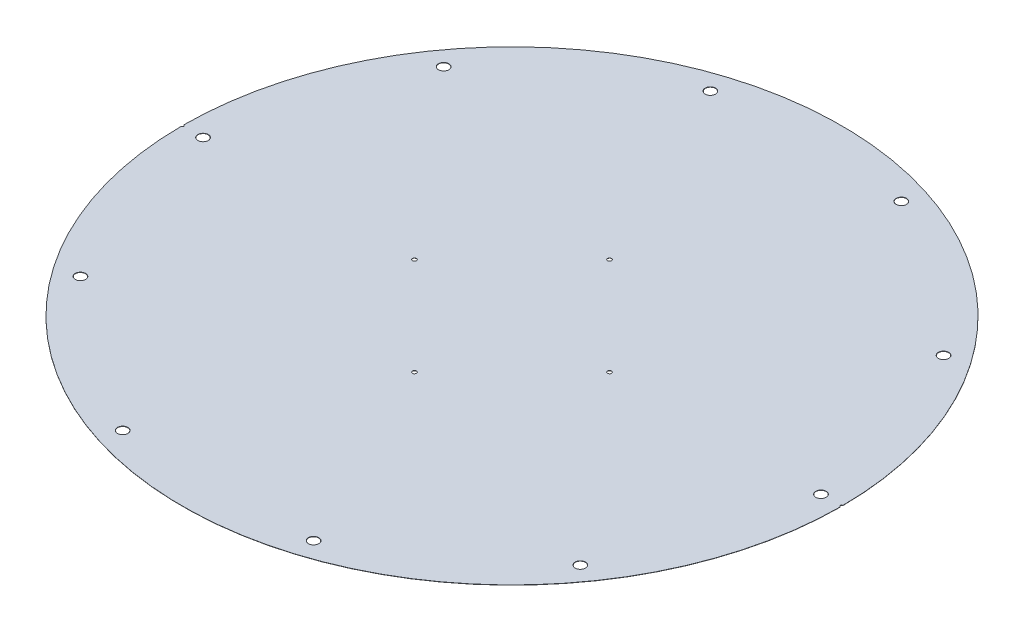
ISO-10303-21;
HEADER;
FILE_DESCRIPTION(('STEP AP214'),'2;1');
FILE_NAME('part.step','',(''),(''),'','','');
FILE_SCHEMA(('AUTOMOTIVE_DESIGN { 1 0 10303 214 1 1 1 1 }'));
ENDSEC;
DATA;
#1=APPLICATION_CONTEXT('core data for automotive mechanical design processes');
#2=APPLICATION_PROTOCOL_DEFINITION('international standard','automotive_design',2000,#1);
#3=PRODUCT_CONTEXT('',#1,'mechanical');
#4=PRODUCT('Part','Part','',(#3));
#5=PRODUCT_RELATED_PRODUCT_CATEGORY('part','',(#4));
#6=PRODUCT_DEFINITION_FORMATION('','',#4);
#7=PRODUCT_DEFINITION_CONTEXT('part definition',#1,'design');
#8=PRODUCT_DEFINITION('design','',#6,#7);
#9=PRODUCT_DEFINITION_SHAPE('','',#8);
#10=(LENGTH_UNIT() NAMED_UNIT(*) SI_UNIT(.MILLI.,.METRE.));
#11=(NAMED_UNIT(*) PLANE_ANGLE_UNIT() SI_UNIT($,.RADIAN.));
#12=(NAMED_UNIT(*) SI_UNIT($,.STERADIAN.) SOLID_ANGLE_UNIT());
#13=UNCERTAINTY_MEASURE_WITH_UNIT(LENGTH_MEASURE(1.E-05),#10,'distance_accuracy_value','');
#14=(GEOMETRIC_REPRESENTATION_CONTEXT(3) GLOBAL_UNCERTAINTY_ASSIGNED_CONTEXT((#13)) GLOBAL_UNIT_ASSIGNED_CONTEXT((#10,
#11,#12)) REPRESENTATION_CONTEXT('',''));
#15=CARTESIAN_POINT('',(0.,0.,0.));
#16=DIRECTION('',(0.,0.,1.));
#17=DIRECTION('',(1.,0.,0.));
#18=AXIS2_PLACEMENT_3D('',#15,#16,#17);
#19=CARTESIAN_POINT('',(0.,6.35,0.));
#20=DIRECTION('',(0.,-1.,0.));
#21=DIRECTION('',(0.,0.,-1.));
#22=AXIS2_PLACEMENT_3D('',#19,#20,#21);
#23=CYLINDRICAL_SURFACE('',#22,406.4);
#24=CARTESIAN_POINT('',(0.,6.096,0.));
#25=DIRECTION('',(0.,-1.,0.));
#26=DIRECTION('',(0.,0.,-1.));
#27=AXIS2_PLACEMENT_3D('',#24,#25,#26);
#28=CIRCLE('',#27,406.4);
#29=CARTESIAN_POINT('',(-406.396899414062,6.096,-1.58749697208188));
#30=VERTEX_POINT('',#29);
#31=CARTESIAN_POINT('',(406.396899414062,6.096,-1.58749697208138));
#32=VERTEX_POINT('',#31);
#33=EDGE_CURVE('E76',#30,#32,#28,.T.);
#34=ORIENTED_EDGE('',*,*,#33,.F.);
#35=DIRECTION('',(0.,1.,0.));
#36=VECTOR('',#35,1.);
#37=CARTESIAN_POINT('',(-406.396899414062,3.175,-1.58749697208118));
#38=LINE('',#37,#36);
#39=CARTESIAN_POINT('',(-406.396899414062,6.35,-1.58749697208118));
#40=VERTEX_POINT('',#39);
#41=EDGE_CURVE('E93',#30,#40,#38,.T.);
#42=ORIENTED_EDGE('',*,*,#41,.T.);
#43=CARTESIAN_POINT('',(0.,6.35,0.));
#44=DIRECTION('',(0.,1.,0.));
#45=DIRECTION('',(0.,0.,1.));
#46=AXIS2_PLACEMENT_3D('',#43,#44,#45);
#47=CIRCLE('',#46,406.4);
#48=CARTESIAN_POINT('',(406.396899414062,6.35,-1.58749697208118));
#49=VERTEX_POINT('',#48);
#50=EDGE_CURVE('E110',#49,#40,#47,.T.);
#51=ORIENTED_EDGE('',*,*,#50,.F.);
#52=DIRECTION('',(0.,1.,0.));
#53=VECTOR('',#52,1.);
#54=CARTESIAN_POINT('',(406.396899414062,3.175,-1.58749697208118));
#55=LINE('',#54,#53);
#56=EDGE_CURVE('E42',#49,#32,#55,.F.);
#57=ORIENTED_EDGE('',*,*,#56,.T.);
#58=EDGE_LOOP('',(#34,#42,#51,#57));
#59=FACE_BOUND('',#58,.T.);
#60=ADVANCED_FACE('F35',(#59),#23,.T.);
#61=CARTESIAN_POINT('',(0.,6.096,0.));
#62=DIRECTION('',(0.,-1.,0.));
#63=DIRECTION('',(0.,0.,-1.));
#64=AXIS2_PLACEMENT_3D('',#61,#62,#63);
#65=CIRCLE('',#64,406.4);
#66=CARTESIAN_POINT('',(406.396899414062,6.096,1.58749697208114));
#67=VERTEX_POINT('',#66);
#68=CARTESIAN_POINT('',(-406.396899414062,6.096,1.58749697208118));
#69=VERTEX_POINT('',#68);
#70=EDGE_CURVE('E49',#67,#69,#65,.T.);
#71=ORIENTED_EDGE('',*,*,#70,.F.);
#72=DIRECTION('',(0.,1.,0.));
#73=VECTOR('',#72,1.);
#74=CARTESIAN_POINT('',(406.396899414062,3.175,1.58749697208118));
#75=LINE('',#74,#73);
#76=CARTESIAN_POINT('',(406.396899414062,6.35,1.58749697208118));
#77=VERTEX_POINT('',#76);
#78=EDGE_CURVE('E12',#67,#77,#75,.T.);
#79=ORIENTED_EDGE('',*,*,#78,.T.);
#80=CARTESIAN_POINT('',(-406.396899414062,6.35,1.58749697208118));
#81=VERTEX_POINT('',#80);
#82=EDGE_CURVE('E113',#81,#77,#47,.T.);
#83=ORIENTED_EDGE('',*,*,#82,.F.);
#84=DIRECTION('',(0.,1.,0.));
#85=VECTOR('',#84,1.);
#86=CARTESIAN_POINT('',(-406.396899414062,3.175,1.58749697208118));
#87=LINE('',#86,#85);
#88=EDGE_CURVE('E82',#81,#69,#87,.F.);
#89=ORIENTED_EDGE('',*,*,#88,.T.);
#90=EDGE_LOOP('',(#71,#79,#83,#89));
#91=FACE_BOUND('',#90,.T.);
#92=ADVANCED_FACE('F81',(#91),#23,.T.);
#93=CARTESIAN_POINT('',(-117.735474856852,6.35,-362.352532708434));
#94=DIRECTION('',(0.,1.,0.));
#95=DIRECTION('',(0.,0.,1.));
#96=AXIS2_PLACEMENT_3D('',#93,#94,#95);
#97=CONICAL_SURFACE('',#96,6.4389,0.715584993317675);
#98=CARTESIAN_POINT('',(-117.735474856852,6.35,-362.352532708434));
#99=DIRECTION('',(0.,1.,0.));
#100=DIRECTION('',(0.,0.,1.));
#101=AXIS2_PLACEMENT_3D('',#98,#99,#100);
#102=CIRCLE('',#101,6.4389);
#103=CARTESIAN_POINT('',(-117.735474856852,6.35,-355.913632708433));
#104=VERTEX_POINT('',#103);
#105=EDGE_CURVE('E114',#104,#104,#102,.T.);
#106=ORIENTED_EDGE('',*,*,#105,.T.);
#107=EDGE_LOOP('',(#106));
#108=FACE_BOUND('',#107,.T.);
#109=CARTESIAN_POINT('',(-117.735474856852,6.096,-362.352532708434));
#110=DIRECTION('',(0.,-1.,0.));
#111=DIRECTION('',(0.,0.,-1.));
#112=AXIS2_PLACEMENT_3D('',#109,#110,#111);
#113=CIRCLE('',#112,6.21810116859467);
#114=CARTESIAN_POINT('',(-117.735474856852,6.096,-368.570633877028));
#115=VERTEX_POINT('',#114);
#116=EDGE_CURVE('E126',#115,#115,#113,.F.);
#117=ORIENTED_EDGE('',*,*,#116,.F.);
#118=EDGE_LOOP('',(#117));
#119=FACE_BOUND('',#118,.T.);
#120=ADVANCED_FACE('F295',(#108,#119),#97,.F.);
#121=CARTESIAN_POINT('',(-308.235474856828,6.35,-223.94618112338));
#122=DIRECTION('',(0.,1.,0.));
#123=DIRECTION('',(0.,0.,1.));
#124=AXIS2_PLACEMENT_3D('',#121,#122,#123);
#125=CONICAL_SURFACE('',#124,6.43890000000003,0.715584993317679);
#126=CARTESIAN_POINT('',(-308.235474856828,6.35,-223.94618112338));
#127=DIRECTION('',(0.,1.,0.));
#128=DIRECTION('',(0.,0.,1.));
#129=AXIS2_PLACEMENT_3D('',#126,#127,#128);
#130=CIRCLE('',#129,6.43890000000003);
#131=CARTESIAN_POINT('',(-308.235474856828,6.35,-217.50728112338));
#132=VERTEX_POINT('',#131);
#133=EDGE_CURVE('E129',#132,#132,#130,.T.);
#134=ORIENTED_EDGE('',*,*,#133,.T.);
#135=EDGE_LOOP('',(#134));
#136=FACE_BOUND('',#135,.T.);
#137=CARTESIAN_POINT('',(-308.235474856828,6.096,-223.94618112338));
#138=DIRECTION('',(0.,-1.,0.));
#139=DIRECTION('',(0.,0.,-1.));
#140=AXIS2_PLACEMENT_3D('',#137,#138,#139);
#141=CIRCLE('',#140,6.2181011685947);
#142=CARTESIAN_POINT('',(-308.235474856828,6.096,-230.164282291974));
#143=VERTEX_POINT('',#142);
#144=EDGE_CURVE('E280',#143,#143,#141,.F.);
#145=ORIENTED_EDGE('',*,*,#144,.F.);
#146=EDGE_LOOP('',(#145));
#147=FACE_BOUND('',#146,.T.);
#148=ADVANCED_FACE('F274',(#136,#147),#125,.F.);
#149=CARTESIAN_POINT('',(-380.999999999935,6.35,6.49720277579036E-11));
#150=DIRECTION('',(0.,1.,0.));
#151=DIRECTION('',(0.,0.,1.));
#152=AXIS2_PLACEMENT_3D('',#149,#150,#151);
#153=CONICAL_SURFACE('',#152,6.43890000000003,0.715584993317679);
#154=CARTESIAN_POINT('',(-380.999999999935,6.35,6.49720277579036E-11));
#155=DIRECTION('',(0.,1.,0.));
#156=DIRECTION('',(0.,0.,1.));
#157=AXIS2_PLACEMENT_3D('',#154,#155,#156);
#158=CIRCLE('',#157,6.43890000000003);
#159=CARTESIAN_POINT('',(-380.999999999935,6.35,6.438900000065));
#160=VERTEX_POINT('',#159);
#161=EDGE_CURVE('E133',#160,#160,#158,.T.);
#162=ORIENTED_EDGE('',*,*,#161,.T.);
#163=EDGE_LOOP('',(#162));
#164=FACE_BOUND('',#163,.T.);
#165=CARTESIAN_POINT('',(-380.999999999935,6.096,6.49720277579036E-11));
#166=DIRECTION('',(0.,-1.,0.));
#167=DIRECTION('',(0.,0.,-1.));
#168=AXIS2_PLACEMENT_3D('',#165,#166,#167);
#169=CIRCLE('',#168,6.2181011685947);
#170=CARTESIAN_POINT('',(-380.999999999935,6.096,-6.21810116852973));
#171=VERTEX_POINT('',#170);
#172=EDGE_CURVE('E278',#171,#171,#169,.F.);
#173=ORIENTED_EDGE('',*,*,#172,.F.);
#174=EDGE_LOOP('',(#173));
#175=FACE_BOUND('',#174,.T.);
#176=ADVANCED_FACE('F270',(#164,#175),#153,.F.);
#177=CARTESIAN_POINT('',(-308.235474856752,6.35,223.946181123485));
#178=DIRECTION('',(0.,1.,0.));
#179=DIRECTION('',(0.,0.,1.));
#180=AXIS2_PLACEMENT_3D('',#177,#178,#179);
#181=CONICAL_SURFACE('',#180,6.43890000000003,0.715584993317679);
#182=CARTESIAN_POINT('',(-308.235474856752,6.35,223.946181123485));
#183=DIRECTION('',(0.,1.,0.));
#184=DIRECTION('',(0.,0.,1.));
#185=AXIS2_PLACEMENT_3D('',#182,#183,#184);
#186=CIRCLE('',#185,6.43890000000003);
#187=CARTESIAN_POINT('',(-308.235474856752,6.35,230.385081123485));
#188=VERTEX_POINT('',#187);
#189=EDGE_CURVE('E137',#188,#188,#186,.T.);
#190=ORIENTED_EDGE('',*,*,#189,.T.);
#191=EDGE_LOOP('',(#190));
#192=FACE_BOUND('',#191,.T.);
#193=CARTESIAN_POINT('',(-308.235474856752,6.096,223.946181123485));
#194=DIRECTION('',(0.,-1.,0.));
#195=DIRECTION('',(0.,0.,-1.));
#196=AXIS2_PLACEMENT_3D('',#193,#194,#195);
#197=CIRCLE('',#196,6.2181011685947);
#198=CARTESIAN_POINT('',(-308.235474856752,6.096,217.72807995489));
#199=VERTEX_POINT('',#198);
#200=EDGE_CURVE('E281',#199,#199,#197,.F.);
#201=ORIENTED_EDGE('',*,*,#200,.F.);
#202=EDGE_LOOP('',(#201));
#203=FACE_BOUND('',#202,.T.);
#204=ADVANCED_FACE('F273',(#192,#203),#181,.F.);
#205=CARTESIAN_POINT('',(-117.735474856728,6.35,362.352532708474));
#206=DIRECTION('',(0.,1.,0.));
#207=DIRECTION('',(0.,0.,1.));
#208=AXIS2_PLACEMENT_3D('',#205,#206,#207);
#209=CONICAL_SURFACE('',#208,6.4389,0.715584993317675);
#210=CARTESIAN_POINT('',(-117.735474856728,6.35,362.352532708474));
#211=DIRECTION('',(0.,1.,0.));
#212=DIRECTION('',(0.,0.,1.));
#213=AXIS2_PLACEMENT_3D('',#210,#211,#212);
#214=CIRCLE('',#213,6.4389);
#215=CARTESIAN_POINT('',(-117.735474856728,6.35,368.791432708474));
#216=VERTEX_POINT('',#215);
#217=EDGE_CURVE('E201',#216,#216,#214,.T.);
#218=ORIENTED_EDGE('',*,*,#217,.T.);
#219=EDGE_LOOP('',(#218));
#220=FACE_BOUND('',#219,.T.);
#221=CARTESIAN_POINT('',(-117.735474856728,6.096,362.352532708474));
#222=DIRECTION('',(0.,-1.,0.));
#223=DIRECTION('',(0.,0.,-1.));
#224=AXIS2_PLACEMENT_3D('',#221,#222,#223);
#225=CIRCLE('',#224,6.21810116859467);
#226=CARTESIAN_POINT('',(-117.735474856728,6.096,356.134431539879));
#227=VERTEX_POINT('',#226);
#228=EDGE_CURVE('E286',#227,#227,#225,.F.);
#229=ORIENTED_EDGE('',*,*,#228,.F.);
#230=EDGE_LOOP('',(#229));
#231=FACE_BOUND('',#230,.T.);
#232=ADVANCED_FACE('F336',(#220,#231),#209,.F.);
#233=CARTESIAN_POINT('',(117.735474856982,6.35,362.352532708395));
#234=DIRECTION('',(0.,1.,0.));
#235=DIRECTION('',(0.,0.,1.));
#236=AXIS2_PLACEMENT_3D('',#233,#234,#235);
#237=CONICAL_SURFACE('',#236,6.4389,0.715584993317675);
#238=CARTESIAN_POINT('',(117.735474856982,6.35,362.352532708395));
#239=DIRECTION('',(0.,1.,0.));
#240=DIRECTION('',(0.,0.,1.));
#241=AXIS2_PLACEMENT_3D('',#238,#239,#240);
#242=CIRCLE('',#241,6.4389);
#243=CARTESIAN_POINT('',(117.735474856982,6.35,368.791432708395));
#244=VERTEX_POINT('',#243);
#245=EDGE_CURVE('E205',#244,#244,#242,.T.);
#246=ORIENTED_EDGE('',*,*,#245,.T.);
#247=EDGE_LOOP('',(#246));
#248=FACE_BOUND('',#247,.T.);
#249=CARTESIAN_POINT('',(117.735474856982,6.096,362.352532708395));
#250=DIRECTION('',(0.,-1.,0.));
#251=DIRECTION('',(0.,0.,-1.));
#252=AXIS2_PLACEMENT_3D('',#249,#250,#251);
#253=CIRCLE('',#252,6.21810116859467);
#254=CARTESIAN_POINT('',(117.735474856982,6.096,356.1344315398));
#255=VERTEX_POINT('',#254);
#256=EDGE_CURVE('E496',#255,#255,#253,.F.);
#257=ORIENTED_EDGE('',*,*,#256,.F.);
#258=EDGE_LOOP('',(#257));
#259=FACE_BOUND('',#258,.T.);
#260=ADVANCED_FACE('F346',(#248,#259),#237,.F.);
#261=CARTESIAN_POINT('',(308.235474856958,6.35,223.94618112338));
#262=DIRECTION('',(0.,1.,0.));
#263=DIRECTION('',(0.,0.,1.));
#264=AXIS2_PLACEMENT_3D('',#261,#262,#263);
#265=CONICAL_SURFACE('',#264,6.43890000000003,0.715584993317679);
#266=CARTESIAN_POINT('',(308.235474856958,6.35,223.94618112338));
#267=DIRECTION('',(0.,1.,0.));
#268=DIRECTION('',(0.,0.,1.));
#269=AXIS2_PLACEMENT_3D('',#266,#267,#268);
#270=CIRCLE('',#269,6.43890000000003);
#271=CARTESIAN_POINT('',(308.235474856958,6.35,230.38508112338));
#272=VERTEX_POINT('',#271);
#273=EDGE_CURVE('E209',#272,#272,#270,.T.);
#274=ORIENTED_EDGE('',*,*,#273,.T.);
#275=EDGE_LOOP('',(#274));
#276=FACE_BOUND('',#275,.T.);
#277=CARTESIAN_POINT('',(308.235474856958,6.096,223.94618112338));
#278=DIRECTION('',(0.,-1.,0.));
#279=DIRECTION('',(0.,0.,-1.));
#280=AXIS2_PLACEMENT_3D('',#277,#278,#279);
#281=CIRCLE('',#280,6.2181011685947);
#282=CARTESIAN_POINT('',(308.235474856958,6.096,217.728079954785));
#283=VERTEX_POINT('',#282);
#284=EDGE_CURVE('E493',#283,#283,#281,.F.);
#285=ORIENTED_EDGE('',*,*,#284,.F.);
#286=EDGE_LOOP('',(#285));
#287=FACE_BOUND('',#286,.T.);
#288=ADVANCED_FACE('F356',(#276,#287),#265,.F.);
#289=CARTESIAN_POINT('',(381.000000000065,6.35,-6.4925368714856E-11));
#290=DIRECTION('',(0.,1.,0.));
#291=DIRECTION('',(0.,0.,1.));
#292=AXIS2_PLACEMENT_3D('',#289,#290,#291);
#293=CONICAL_SURFACE('',#292,6.43890000000003,0.715584993317679);
#294=CARTESIAN_POINT('',(381.000000000065,6.35,-6.4925368714856E-11));
#295=DIRECTION('',(0.,1.,0.));
#296=DIRECTION('',(0.,0.,1.));
#297=AXIS2_PLACEMENT_3D('',#294,#295,#296);
#298=CIRCLE('',#297,6.43890000000003);
#299=CARTESIAN_POINT('',(381.000000000065,6.35,6.4388999999351));
#300=VERTEX_POINT('',#299);
#301=EDGE_CURVE('E217',#300,#300,#298,.T.);
#302=ORIENTED_EDGE('',*,*,#301,.T.);
#303=EDGE_LOOP('',(#302));
#304=FACE_BOUND('',#303,.T.);
#305=CARTESIAN_POINT('',(381.000000000065,6.096,-6.4925368714856E-11));
#306=DIRECTION('',(0.,-1.,0.));
#307=DIRECTION('',(0.,0.,-1.));
#308=AXIS2_PLACEMENT_3D('',#305,#306,#307);
#309=CIRCLE('',#308,6.2181011685947);
#310=CARTESIAN_POINT('',(381.000000000065,6.096,-6.21810116865963));
#311=VERTEX_POINT('',#310);
#312=EDGE_CURVE('E490',#311,#311,#309,.F.);
#313=ORIENTED_EDGE('',*,*,#312,.F.);
#314=EDGE_LOOP('',(#313));
#315=FACE_BOUND('',#314,.T.);
#316=ADVANCED_FACE('F366',(#304,#315),#293,.F.);
#317=CARTESIAN_POINT('',(308.235474856882,6.35,-223.946181123485));
#318=DIRECTION('',(0.,1.,0.));
#319=DIRECTION('',(0.,0.,1.));
#320=AXIS2_PLACEMENT_3D('',#317,#318,#319);
#321=CONICAL_SURFACE('',#320,6.43890000000003,0.715584993317679);
#322=CARTESIAN_POINT('',(308.235474856882,6.35,-223.946181123485));
#323=DIRECTION('',(0.,1.,0.));
#324=DIRECTION('',(0.,0.,1.));
#325=AXIS2_PLACEMENT_3D('',#322,#323,#324);
#326=CIRCLE('',#325,6.43890000000003);
#327=CARTESIAN_POINT('',(308.235474856882,6.35,-217.507281123485));
#328=VERTEX_POINT('',#327);
#329=EDGE_CURVE('E220',#328,#328,#326,.T.);
#330=ORIENTED_EDGE('',*,*,#329,.T.);
#331=EDGE_LOOP('',(#330));
#332=FACE_BOUND('',#331,.T.);
#333=CARTESIAN_POINT('',(308.235474856882,6.096,-223.946181123485));
#334=DIRECTION('',(0.,-1.,0.));
#335=DIRECTION('',(0.,0.,-1.));
#336=AXIS2_PLACEMENT_3D('',#333,#334,#335);
#337=CIRCLE('',#336,6.2181011685947);
#338=CARTESIAN_POINT('',(308.235474856882,6.096,-230.164282292079));
#339=VERTEX_POINT('',#338);
#340=EDGE_CURVE('E487',#339,#339,#337,.F.);
#341=ORIENTED_EDGE('',*,*,#340,.F.);
#342=EDGE_LOOP('',(#341));
#343=FACE_BOUND('',#342,.T.);
#344=ADVANCED_FACE('F376',(#332,#343),#321,.F.);
#345=CARTESIAN_POINT('',(117.735474856858,6.35,-362.352532708474));
#346=DIRECTION('',(0.,1.,0.));
#347=DIRECTION('',(0.,0.,1.));
#348=AXIS2_PLACEMENT_3D('',#345,#346,#347);
#349=CONICAL_SURFACE('',#348,6.4389,0.715584993317675);
#350=CARTESIAN_POINT('',(117.735474856858,6.35,-362.352532708474));
#351=DIRECTION('',(0.,1.,0.));
#352=DIRECTION('',(0.,0.,1.));
#353=AXIS2_PLACEMENT_3D('',#350,#351,#352);
#354=CIRCLE('',#353,6.4389);
#355=CARTESIAN_POINT('',(117.735474856858,6.35,-355.913632708474));
#356=VERTEX_POINT('',#355);
#357=EDGE_CURVE('E224',#356,#356,#354,.T.);
#358=ORIENTED_EDGE('',*,*,#357,.T.);
#359=EDGE_LOOP('',(#358));
#360=FACE_BOUND('',#359,.T.);
#361=CARTESIAN_POINT('',(117.735474856858,6.096,-362.352532708474));
#362=DIRECTION('',(0.,-1.,0.));
#363=DIRECTION('',(0.,0.,-1.));
#364=AXIS2_PLACEMENT_3D('',#361,#362,#363);
#365=CIRCLE('',#364,6.21810116859467);
#366=CARTESIAN_POINT('',(117.735474856858,6.096,-368.570633877068));
#367=VERTEX_POINT('',#366);
#368=EDGE_CURVE('E484',#367,#367,#365,.F.);
#369=ORIENTED_EDGE('',*,*,#368,.F.);
#370=EDGE_LOOP('',(#369));
#371=FACE_BOUND('',#370,.T.);
#372=ADVANCED_FACE('F386',(#360,#371),#349,.F.);
#373=CARTESIAN_POINT('',(-120.2562999999,6.35,0.));
#374=DIRECTION('',(0.,1.,0.));
#375=DIRECTION('',(0.,0.,1.));
#376=AXIS2_PLACEMENT_3D('',#373,#374,#375);
#377=CYLINDRICAL_SURFACE('',#376,2.45745);
#378=CARTESIAN_POINT('',(-120.2562999999,6.35,0.));
#379=DIRECTION('',(0.,1.,0.));
#380=DIRECTION('',(0.,0.,1.));
#381=AXIS2_PLACEMENT_3D('',#378,#379,#380);
#382=CIRCLE('',#381,2.45745);
#383=CARTESIAN_POINT('',(-120.2562999999,6.35,2.45745000000001));
#384=VERTEX_POINT('',#383);
#385=EDGE_CURVE('E228',#384,#384,#382,.T.);
#386=ORIENTED_EDGE('',*,*,#385,.T.);
#387=EDGE_LOOP('',(#386));
#388=FACE_BOUND('',#387,.T.);
#389=CARTESIAN_POINT('',(-120.2562999999,6.096,0.));
#390=DIRECTION('',(0.,-1.,0.));
#391=DIRECTION('',(0.,0.,-1.));
#392=AXIS2_PLACEMENT_3D('',#389,#390,#391);
#393=CIRCLE('',#392,2.45745);
#394=CARTESIAN_POINT('',(-120.2562999999,6.096,-2.45744999999999));
#395=VERTEX_POINT('',#394);
#396=EDGE_CURVE('E481',#395,#395,#393,.F.);
#397=ORIENTED_EDGE('',*,*,#396,.F.);
#398=EDGE_LOOP('',(#397));
#399=FACE_BOUND('',#398,.T.);
#400=ADVANCED_FACE('F396',(#388,#399),#377,.F.);
#401=CARTESIAN_POINT('',(6.49064135771482E-11,6.35,-120.256299999965));
#402=DIRECTION('',(0.,1.,0.));
#403=DIRECTION('',(0.,0.,1.));
#404=AXIS2_PLACEMENT_3D('',#401,#402,#403);
#405=CYLINDRICAL_SURFACE('',#404,2.45745);
#406=CARTESIAN_POINT('',(6.49064135771482E-11,6.35,-120.256299999965));
#407=DIRECTION('',(0.,1.,0.));
#408=DIRECTION('',(0.,0.,1.));
#409=AXIS2_PLACEMENT_3D('',#406,#407,#408);
#410=CIRCLE('',#409,2.45745);
#411=CARTESIAN_POINT('',(6.49064135771482E-11,6.35,-117.798849999965));
#412=VERTEX_POINT('',#411);
#413=EDGE_CURVE('E233',#412,#412,#410,.T.);
#414=ORIENTED_EDGE('',*,*,#413,.T.);
#415=EDGE_LOOP('',(#414));
#416=FACE_BOUND('',#415,.T.);
#417=CARTESIAN_POINT('',(6.49064135771482E-11,6.096,-120.256299999965));
#418=DIRECTION('',(0.,-1.,0.));
#419=DIRECTION('',(0.,0.,-1.));
#420=AXIS2_PLACEMENT_3D('',#417,#418,#419);
#421=CIRCLE('',#420,2.45745);
#422=CARTESIAN_POINT('',(6.49064135771482E-11,6.096,-122.713749999965));
#423=VERTEX_POINT('',#422);
#424=EDGE_CURVE('E478',#423,#423,#421,.F.);
#425=ORIENTED_EDGE('',*,*,#424,.F.);
#426=EDGE_LOOP('',(#425));
#427=FACE_BOUND('',#426,.T.);
#428=ADVANCED_FACE('F406',(#416,#427),#405,.F.);
#429=CARTESIAN_POINT('',(120.256300000029,6.35,4.19872627328201E-13));
#430=DIRECTION('',(0.,1.,0.));
#431=DIRECTION('',(0.,0.,1.));
#432=AXIS2_PLACEMENT_3D('',#429,#430,#431);
#433=CYLINDRICAL_SURFACE('',#432,2.45745);
#434=CARTESIAN_POINT('',(120.256300000029,6.35,4.19872627328201E-13));
#435=DIRECTION('',(0.,1.,0.));
#436=DIRECTION('',(0.,0.,1.));
#437=AXIS2_PLACEMENT_3D('',#434,#435,#436);
#438=CIRCLE('',#437,2.45745);
#439=CARTESIAN_POINT('',(120.256300000029,6.35,2.45745000000042));
#440=VERTEX_POINT('',#439);
#441=EDGE_CURVE('E96',#440,#440,#438,.T.);
#442=ORIENTED_EDGE('',*,*,#441,.T.);
#443=EDGE_LOOP('',(#442));
#444=FACE_BOUND('',#443,.T.);
#445=CARTESIAN_POINT('',(120.256300000029,6.096,4.19872627328201E-13));
#446=DIRECTION('',(0.,-1.,0.));
#447=DIRECTION('',(0.,0.,-1.));
#448=AXIS2_PLACEMENT_3D('',#445,#446,#447);
#449=CIRCLE('',#448,2.45745);
#450=CARTESIAN_POINT('',(120.256300000029,6.096,-2.45744999999958));
#451=VERTEX_POINT('',#450);
#452=EDGE_CURVE('E475',#451,#451,#449,.F.);
#453=ORIENTED_EDGE('',*,*,#452,.F.);
#454=EDGE_LOOP('',(#453));
#455=FACE_BOUND('',#454,.T.);
#456=ADVANCED_FACE('F240',(#444,#455),#433,.F.);
#457=CARTESIAN_POINT('',(6.4920291364956E-11,6.35,120.256299999965));
#458=DIRECTION('',(0.,1.,0.));
#459=DIRECTION('',(0.,0.,1.));
#460=AXIS2_PLACEMENT_3D('',#457,#458,#459);
#461=CYLINDRICAL_SURFACE('',#460,2.45745);
#462=CARTESIAN_POINT('',(6.4920291364956E-11,6.35,120.256299999965));
#463=DIRECTION('',(0.,1.,0.));
#464=DIRECTION('',(0.,0.,1.));
#465=AXIS2_PLACEMENT_3D('',#462,#463,#464);
#466=CIRCLE('',#465,2.45745);
#467=CARTESIAN_POINT('',(6.4920291364956E-11,6.35,122.713749999965));
#468=VERTEX_POINT('',#467);
#469=EDGE_CURVE('E92',#468,#468,#466,.T.);
#470=ORIENTED_EDGE('',*,*,#469,.T.);
#471=EDGE_LOOP('',(#470));
#472=FACE_BOUND('',#471,.T.);
#473=CARTESIAN_POINT('',(6.4920291364956E-11,6.096,120.256299999965));
#474=DIRECTION('',(0.,-1.,0.));
#475=DIRECTION('',(0.,0.,-1.));
#476=AXIS2_PLACEMENT_3D('',#473,#474,#475);
#477=CIRCLE('',#476,2.45745);
#478=CARTESIAN_POINT('',(6.4920291364956E-11,6.096,117.798849999965));
#479=VERTEX_POINT('',#478);
#480=EDGE_CURVE('E470',#479,#479,#477,.F.);
#481=ORIENTED_EDGE('',*,*,#480,.F.);
#482=EDGE_LOOP('',(#481));
#483=FACE_BOUND('',#482,.T.);
#484=ADVANCED_FACE('F425',(#472,#483),#461,.F.);
#485=CARTESIAN_POINT('',(406.4,6.35,0.));
#486=DIRECTION('',(0.,1.,0.));
#487=DIRECTION('',(0.,0.,1.));
#488=AXIS2_PLACEMENT_3D('',#485,#486,#487);
#489=CYLINDRICAL_SURFACE('',#488,1.58750000000002);
#490=CARTESIAN_POINT('',(406.4,6.096,0.));
#491=DIRECTION('',(0.,1.,0.));
#492=DIRECTION('',(0.,0.,-1.));
#493=AXIS2_PLACEMENT_3D('',#490,#491,#492);
#494=CIRCLE('',#493,1.58750000000016);
#495=EDGE_CURVE('E72',#32,#67,#494,.T.);
#496=ORIENTED_EDGE('',*,*,#495,.F.);
#497=ORIENTED_EDGE('',*,*,#56,.F.);
#498=CARTESIAN_POINT('',(406.4,6.35,0.));
#499=DIRECTION('',(0.,1.,0.));
#500=DIRECTION('',(0.,0.,1.));
#501=AXIS2_PLACEMENT_3D('',#498,#499,#500);
#502=CIRCLE('',#501,1.58750000000002);
#503=EDGE_CURVE('E88',#49,#77,#502,.T.);
#504=ORIENTED_EDGE('',*,*,#503,.T.);
#505=ORIENTED_EDGE('',*,*,#78,.F.);
#506=EDGE_LOOP('',(#496,#497,#504,#505));
#507=FACE_BOUND('',#506,.T.);
#508=ADVANCED_FACE('F86',(#507),#489,.F.);
#509=CARTESIAN_POINT('',(-406.4,6.35,0.));
#510=DIRECTION('',(0.,1.,0.));
#511=DIRECTION('',(0.,0.,1.));
#512=AXIS2_PLACEMENT_3D('',#509,#510,#511);
#513=CYLINDRICAL_SURFACE('',#512,1.58750000000002);
#514=CARTESIAN_POINT('',(-406.4,6.096,0.));
#515=DIRECTION('',(0.,1.,0.));
#516=DIRECTION('',(0.,0.,-1.));
#517=AXIS2_PLACEMENT_3D('',#514,#515,#516);
#518=CIRCLE('',#517,1.58750000000072);
#519=EDGE_CURVE('E83',#69,#30,#518,.T.);
#520=ORIENTED_EDGE('',*,*,#519,.F.);
#521=ORIENTED_EDGE('',*,*,#88,.F.);
#522=CARTESIAN_POINT('',(-406.4,6.35,0.));
#523=DIRECTION('',(0.,1.,0.));
#524=DIRECTION('',(0.,0.,1.));
#525=AXIS2_PLACEMENT_3D('',#522,#523,#524);
#526=CIRCLE('',#525,1.58750000000002);
#527=EDGE_CURVE('E124',#81,#40,#526,.T.);
#528=ORIENTED_EDGE('',*,*,#527,.T.);
#529=ORIENTED_EDGE('',*,*,#41,.F.);
#530=EDGE_LOOP('',(#520,#521,#528,#529));
#531=FACE_BOUND('',#530,.T.);
#532=ADVANCED_FACE('F245',(#531),#513,.F.);
#533=CARTESIAN_POINT('',(0.,6.35,0.));
#534=DIRECTION('',(0.,1.,0.));
#535=DIRECTION('',(0.,0.,1.));
#536=AXIS2_PLACEMENT_3D('',#533,#534,#535);
#537=PLANE('',#536);
#538=ORIENTED_EDGE('',*,*,#527,.F.);
#539=ORIENTED_EDGE('',*,*,#82,.T.);
#540=ORIENTED_EDGE('',*,*,#503,.F.);
#541=ORIENTED_EDGE('',*,*,#50,.T.);
#542=EDGE_LOOP('',(#538,#539,#540,#541));
#543=FACE_BOUND('',#542,.T.);
#544=ORIENTED_EDGE('',*,*,#469,.F.);
#545=EDGE_LOOP('',(#544));
#546=FACE_BOUND('',#545,.T.);
#547=ORIENTED_EDGE('',*,*,#441,.F.);
#548=EDGE_LOOP('',(#547));
#549=FACE_BOUND('',#548,.T.);
#550=ORIENTED_EDGE('',*,*,#413,.F.);
#551=EDGE_LOOP('',(#550));
#552=FACE_BOUND('',#551,.T.);
#553=ORIENTED_EDGE('',*,*,#385,.F.);
#554=EDGE_LOOP('',(#553));
#555=FACE_BOUND('',#554,.T.);
#556=ORIENTED_EDGE('',*,*,#357,.F.);
#557=EDGE_LOOP('',(#556));
#558=FACE_BOUND('',#557,.T.);
#559=ORIENTED_EDGE('',*,*,#329,.F.);
#560=EDGE_LOOP('',(#559));
#561=FACE_BOUND('',#560,.T.);
#562=ORIENTED_EDGE('',*,*,#301,.F.);
#563=EDGE_LOOP('',(#562));
#564=FACE_BOUND('',#563,.T.);
#565=ORIENTED_EDGE('',*,*,#273,.F.);
#566=EDGE_LOOP('',(#565));
#567=FACE_BOUND('',#566,.T.);
#568=ORIENTED_EDGE('',*,*,#245,.F.);
#569=EDGE_LOOP('',(#568));
#570=FACE_BOUND('',#569,.T.);
#571=ORIENTED_EDGE('',*,*,#217,.F.);
#572=EDGE_LOOP('',(#571));
#573=FACE_BOUND('',#572,.T.);
#574=ORIENTED_EDGE('',*,*,#189,.F.);
#575=EDGE_LOOP('',(#574));
#576=FACE_BOUND('',#575,.T.);
#577=ORIENTED_EDGE('',*,*,#161,.F.);
#578=EDGE_LOOP('',(#577));
#579=FACE_BOUND('',#578,.T.);
#580=ORIENTED_EDGE('',*,*,#133,.F.);
#581=EDGE_LOOP('',(#580));
#582=FACE_BOUND('',#581,.T.);
#583=ORIENTED_EDGE('',*,*,#105,.F.);
#584=EDGE_LOOP('',(#583));
#585=FACE_BOUND('',#584,.T.);
#586=ADVANCED_FACE('F122',(#543,#546,#549,#552,#555,#558,#561,#564,#567,#570,#573,#576,#579,
#582,#585),#537,.T.);
#587=CARTESIAN_POINT('',(203.2,6.096,0.));
#588=DIRECTION('',(0.,-1.,0.));
#589=DIRECTION('',(0.,0.,-1.));
#590=AXIS2_PLACEMENT_3D('',#587,#588,#589);
#591=PLANE('',#590);
#592=ORIENTED_EDGE('',*,*,#495,.T.);
#593=ORIENTED_EDGE('',*,*,#70,.T.);
#594=ORIENTED_EDGE('',*,*,#519,.T.);
#595=ORIENTED_EDGE('',*,*,#33,.T.);
#596=EDGE_LOOP('',(#592,#593,#594,#595));
#597=FACE_BOUND('',#596,.T.);
#598=ORIENTED_EDGE('',*,*,#480,.T.);
#599=EDGE_LOOP('',(#598));
#600=FACE_BOUND('',#599,.T.);
#601=ORIENTED_EDGE('',*,*,#452,.T.);
#602=EDGE_LOOP('',(#601));
#603=FACE_BOUND('',#602,.T.);
#604=ORIENTED_EDGE('',*,*,#424,.T.);
#605=EDGE_LOOP('',(#604));
#606=FACE_BOUND('',#605,.T.);
#607=ORIENTED_EDGE('',*,*,#396,.T.);
#608=EDGE_LOOP('',(#607));
#609=FACE_BOUND('',#608,.T.);
#610=ORIENTED_EDGE('',*,*,#368,.T.);
#611=EDGE_LOOP('',(#610));
#612=FACE_BOUND('',#611,.T.);
#613=ORIENTED_EDGE('',*,*,#340,.T.);
#614=EDGE_LOOP('',(#613));
#615=FACE_BOUND('',#614,.T.);
#616=ORIENTED_EDGE('',*,*,#312,.T.);
#617=EDGE_LOOP('',(#616));
#618=FACE_BOUND('',#617,.T.);
#619=ORIENTED_EDGE('',*,*,#284,.T.);
#620=EDGE_LOOP('',(#619));
#621=FACE_BOUND('',#620,.T.);
#622=ORIENTED_EDGE('',*,*,#256,.T.);
#623=EDGE_LOOP('',(#622));
#624=FACE_BOUND('',#623,.T.);
#625=ORIENTED_EDGE('',*,*,#228,.T.);
#626=EDGE_LOOP('',(#625));
#627=FACE_BOUND('',#626,.T.);
#628=ORIENTED_EDGE('',*,*,#200,.T.);
#629=EDGE_LOOP('',(#628));
#630=FACE_BOUND('',#629,.T.);
#631=ORIENTED_EDGE('',*,*,#172,.T.);
#632=EDGE_LOOP('',(#631));
#633=FACE_BOUND('',#632,.T.);
#634=ORIENTED_EDGE('',*,*,#144,.T.);
#635=EDGE_LOOP('',(#634));
#636=FACE_BOUND('',#635,.T.);
#637=ORIENTED_EDGE('',*,*,#116,.T.);
#638=EDGE_LOOP('',(#637));
#639=FACE_BOUND('',#638,.T.);
#640=ADVANCED_FACE('F73',(#597,#600,#603,#606,#609,#612,#615,#618,#621,#624,#627,#630,#633,#636,
#639),#591,.T.);
#641=CLOSED_SHELL('',(#60,#92,#120,#148,#176,#204,#232,#260,#288,#316,#344,#372,#400,#428,#456,
#484,#508,#532,#586,#640));
#642=MANIFOLD_SOLID_BREP('B2',#641);
#643=ADVANCED_BREP_SHAPE_REPRESENTATION('',(#18,#642),#14);
#644=SHAPE_DEFINITION_REPRESENTATION(#9,#643);
ENDSEC;
END-ISO-10303-21;
